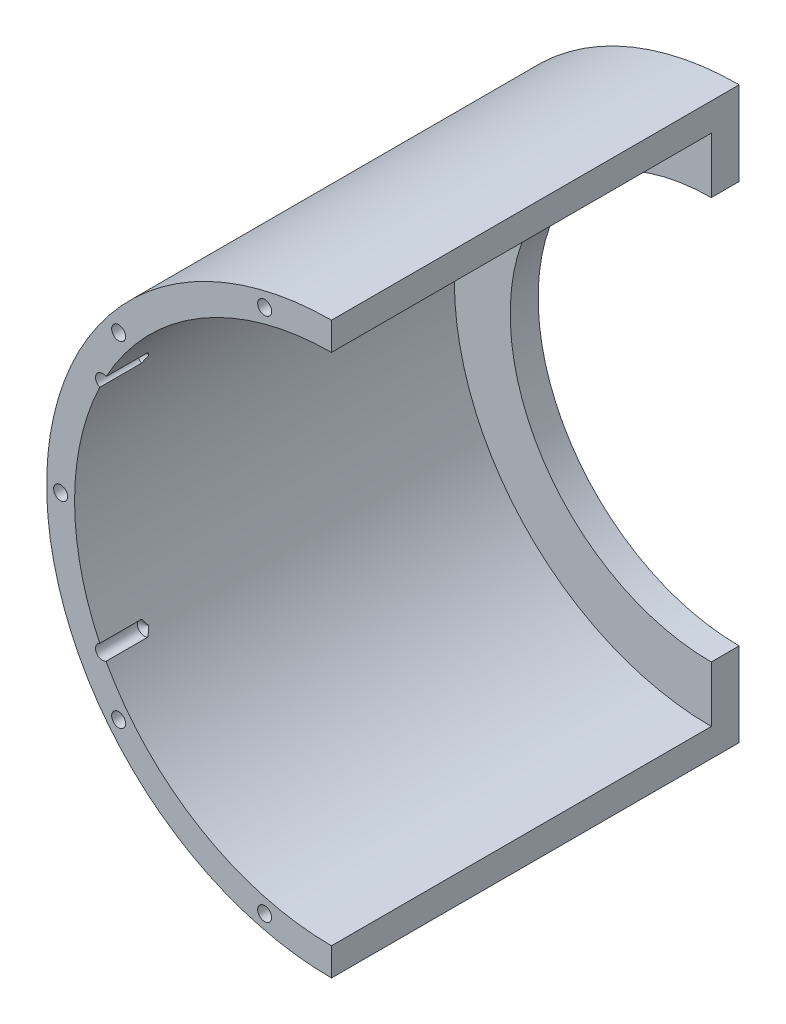
ISO-10303-21;
HEADER;
FILE_DESCRIPTION(('STEP AP214'),'2;1');
FILE_NAME('part.step','',(''),(''),'','','');
FILE_SCHEMA(('AUTOMOTIVE_DESIGN { 1 0 10303 214 1 1 1 1 }'));
ENDSEC;
DATA;
#1=APPLICATION_CONTEXT('core data for automotive mechanical design processes');
#2=APPLICATION_PROTOCOL_DEFINITION('international standard','automotive_design',2000,#1);
#3=PRODUCT_CONTEXT('',#1,'mechanical');
#4=PRODUCT('Part','Part','',(#3));
#5=PRODUCT_RELATED_PRODUCT_CATEGORY('part','',(#4));
#6=PRODUCT_DEFINITION_FORMATION('','',#4);
#7=PRODUCT_DEFINITION_CONTEXT('part definition',#1,'design');
#8=PRODUCT_DEFINITION('design','',#6,#7);
#9=PRODUCT_DEFINITION_SHAPE('','',#8);
#10=(LENGTH_UNIT() NAMED_UNIT(*) SI_UNIT(.MILLI.,.METRE.));
#11=(NAMED_UNIT(*) PLANE_ANGLE_UNIT() SI_UNIT($,.RADIAN.));
#12=(NAMED_UNIT(*) SI_UNIT($,.STERADIAN.) SOLID_ANGLE_UNIT());
#13=UNCERTAINTY_MEASURE_WITH_UNIT(LENGTH_MEASURE(1.E-05),#10,'distance_accuracy_value','');
#14=(GEOMETRIC_REPRESENTATION_CONTEXT(3) GLOBAL_UNCERTAINTY_ASSIGNED_CONTEXT((#13)) GLOBAL_UNIT_ASSIGNED_CONTEXT((#10,
#11,#12)) REPRESENTATION_CONTEXT('',''));
#15=CARTESIAN_POINT('',(0.,0.,0.));
#16=DIRECTION('',(0.,0.,1.));
#17=DIRECTION('',(1.,0.,0.));
#18=AXIS2_PLACEMENT_3D('',#15,#16,#17);
#19=CARTESIAN_POINT('',(0.,-46.,34.));
#20=DIRECTION('',(-1.,0.,0.));
#21=DIRECTION('',(0.,-1.,0.));
#22=AXIS2_PLACEMENT_3D('',#19,#20,#21);
#23=PLANE('',#22);
#24=DIRECTION('',(0.,1.,0.));
#25=VECTOR('',#24,1.);
#26=CARTESIAN_POINT('',(0.,-46.,34.));
#27=LINE('',#26,#25);
#28=CARTESIAN_POINT('',(0.,46.,34.));
#29=VERTEX_POINT('',#28);
#30=CARTESIAN_POINT('',(0.,51.,34.));
#31=VERTEX_POINT('',#30);
#32=EDGE_CURVE('E222',#29,#31,#27,.T.);
#33=ORIENTED_EDGE('',*,*,#32,.F.);
#34=DIRECTION('',(0.,0.,-1.));
#35=VECTOR('',#34,1.);
#36=CARTESIAN_POINT('',(0.,46.,34.));
#37=LINE('',#36,#35);
#38=CARTESIAN_POINT('',(0.,46.,-34.));
#39=VERTEX_POINT('',#38);
#40=EDGE_CURVE('E275',#29,#39,#37,.T.);
#41=ORIENTED_EDGE('',*,*,#40,.T.);
#42=DIRECTION('',(0.,-1.,0.));
#43=VECTOR('',#42,1.);
#44=CARTESIAN_POINT('',(0.,51.,-34.));
#45=LINE('',#44,#43);
#46=CARTESIAN_POINT('',(0.,36.,-34.));
#47=VERTEX_POINT('',#46);
#48=EDGE_CURVE('E228',#39,#47,#45,.T.);
#49=ORIENTED_EDGE('',*,*,#48,.T.);
#50=DIRECTION('',(0.,0.,1.));
#51=VECTOR('',#50,1.);
#52=CARTESIAN_POINT('',(0.,36.,-39.));
#53=LINE('',#52,#51);
#54=CARTESIAN_POINT('',(0.,36.,-39.));
#55=VERTEX_POINT('',#54);
#56=EDGE_CURVE('E404',#55,#47,#53,.T.);
#57=ORIENTED_EDGE('',*,*,#56,.F.);
#58=DIRECTION('',(0.,-1.,0.));
#59=VECTOR('',#58,1.);
#60=CARTESIAN_POINT('',(0.,51.,-39.));
#61=LINE('',#60,#59);
#62=CARTESIAN_POINT('',(0.,51.,-39.));
#63=VERTEX_POINT('',#62);
#64=EDGE_CURVE('E232',#63,#55,#61,.T.);
#65=ORIENTED_EDGE('',*,*,#64,.F.);
#66=DIRECTION('',(0.,0.,-1.));
#67=VECTOR('',#66,1.);
#68=CARTESIAN_POINT('',(0.,51.,34.));
#69=LINE('',#68,#67);
#70=EDGE_CURVE('E315',#31,#63,#69,.T.);
#71=ORIENTED_EDGE('',*,*,#70,.F.);
#72=EDGE_LOOP('',(#33,#41,#49,#57,#65,#71));
#73=FACE_BOUND('',#72,.T.);
#74=ADVANCED_FACE('F76',(#73),#23,.F.);
#75=DIRECTION('',(0.,1.,0.));
#76=VECTOR('',#75,1.);
#77=CARTESIAN_POINT('',(0.,-46.,34.));
#78=LINE('',#77,#76);
#79=CARTESIAN_POINT('',(0.,-51.,34.));
#80=VERTEX_POINT('',#79);
#81=CARTESIAN_POINT('',(0.,-46.,34.));
#82=VERTEX_POINT('',#81);
#83=EDGE_CURVE('E219',#80,#82,#78,.T.);
#84=ORIENTED_EDGE('',*,*,#83,.F.);
#85=DIRECTION('',(0.,0.,-1.));
#86=VECTOR('',#85,1.);
#87=CARTESIAN_POINT('',(0.,-51.,34.));
#88=LINE('',#87,#86);
#89=CARTESIAN_POINT('',(0.,-51.,-39.));
#90=VERTEX_POINT('',#89);
#91=EDGE_CURVE('E317',#80,#90,#88,.T.);
#92=ORIENTED_EDGE('',*,*,#91,.T.);
#93=DIRECTION('',(0.,-1.,0.));
#94=VECTOR('',#93,1.);
#95=CARTESIAN_POINT('',(0.,-51.,-39.));
#96=LINE('',#95,#94);
#97=CARTESIAN_POINT('',(0.,-36.,-39.));
#98=VERTEX_POINT('',#97);
#99=EDGE_CURVE('E237',#98,#90,#96,.T.);
#100=ORIENTED_EDGE('',*,*,#99,.F.);
#101=DIRECTION('',(0.,0.,1.));
#102=VECTOR('',#101,1.);
#103=CARTESIAN_POINT('',(0.,-36.,-39.));
#104=LINE('',#103,#102);
#105=CARTESIAN_POINT('',(0.,-36.,-34.));
#106=VERTEX_POINT('',#105);
#107=EDGE_CURVE('E240',#98,#106,#104,.T.);
#108=ORIENTED_EDGE('',*,*,#107,.T.);
#109=DIRECTION('',(0.,-1.,0.));
#110=VECTOR('',#109,1.);
#111=CARTESIAN_POINT('',(0.,-51.,-34.));
#112=LINE('',#111,#110);
#113=CARTESIAN_POINT('',(0.,-46.,-34.));
#114=VERTEX_POINT('',#113);
#115=EDGE_CURVE('E233',#106,#114,#112,.T.);
#116=ORIENTED_EDGE('',*,*,#115,.T.);
#117=DIRECTION('',(0.,0.,-1.));
#118=VECTOR('',#117,1.);
#119=CARTESIAN_POINT('',(0.,-46.,34.));
#120=LINE('',#119,#118);
#121=EDGE_CURVE('E326',#82,#114,#120,.T.);
#122=ORIENTED_EDGE('',*,*,#121,.F.);
#123=EDGE_LOOP('',(#84,#92,#100,#108,#116,#122));
#124=FACE_BOUND('',#123,.T.);
#125=ADVANCED_FACE('F299',(#124),#23,.F.);
#126=CARTESIAN_POINT('',(0.,0.,34.));
#127=DIRECTION('',(0.,0.,-1.));
#128=DIRECTION('',(-1.,0.,0.));
#129=AXIS2_PLACEMENT_3D('',#126,#127,#128);
#130=CYLINDRICAL_SURFACE('',#129,51.);
#131=CARTESIAN_POINT('',(0.,0.,34.));
#132=DIRECTION('',(0.,0.,1.));
#133=DIRECTION('',(1.,0.,0.));
#134=AXIS2_PLACEMENT_3D('',#131,#132,#133);
#135=CIRCLE('',#134,51.);
#136=EDGE_CURVE('E223',#31,#80,#135,.T.);
#137=ORIENTED_EDGE('',*,*,#136,.F.);
#138=ORIENTED_EDGE('',*,*,#70,.T.);
#139=CARTESIAN_POINT('',(0.,0.,-39.));
#140=DIRECTION('',(0.,0.,-1.));
#141=DIRECTION('',(-1.,0.,0.));
#142=AXIS2_PLACEMENT_3D('',#139,#140,#141);
#143=CIRCLE('',#142,51.);
#144=EDGE_CURVE('E229',#90,#63,#143,.T.);
#145=ORIENTED_EDGE('',*,*,#144,.F.);
#146=ORIENTED_EDGE('',*,*,#91,.F.);
#147=EDGE_LOOP('',(#137,#138,#145,#146));
#148=FACE_BOUND('',#147,.T.);
#149=ADVANCED_FACE('F301',(#148),#130,.T.);
#150=CARTESIAN_POINT('',(-41.,21.,39.));
#151=DIRECTION('',(0.,0.,1.));
#152=DIRECTION('',(1.,0.,0.));
#153=AXIS2_PLACEMENT_3D('',#150,#151,#152);
#154=CYLINDRICAL_SURFACE('',#153,1.24999999999999);
#155=CARTESIAN_POINT('',(-41.,21.,34.));
#156=DIRECTION('',(0.,0.,1.));
#157=DIRECTION('',(1.,0.,0.));
#158=AXIS2_PLACEMENT_3D('',#155,#156,#157);
#159=CIRCLE('',#158,1.24999999999999);
#160=CARTESIAN_POINT('',(-41.4955558245157,19.8524267235646,34.));
#161=VERTEX_POINT('',#160);
#162=CARTESIAN_POINT('',(-40.358326126474,22.0727323245032,34.));
#163=VERTEX_POINT('',#162);
#164=EDGE_CURVE('E214',#161,#163,#159,.F.);
#165=ORIENTED_EDGE('',*,*,#164,.F.);
#166=DIRECTION('',(0.,0.,1.));
#167=VECTOR('',#166,1.);
#168=CARTESIAN_POINT('',(-41.4955558245157,19.8524267235646,32.75));
#169=LINE('',#168,#167);
#170=CARTESIAN_POINT('',(-41.4955558245157,19.8524267235646,26.5));
#171=VERTEX_POINT('',#170);
#172=EDGE_CURVE('E274',#171,#161,#169,.T.);
#173=ORIENTED_EDGE('',*,*,#172,.F.);
#174=CARTESIAN_POINT('',(-41.,21.,26.5));
#175=DIRECTION('',(0.,0.,1.));
#176=DIRECTION('',(1.,0.,0.));
#177=AXIS2_PLACEMENT_3D('',#174,#175,#176);
#178=CIRCLE('',#177,1.24999999999999);
#179=CARTESIAN_POINT('',(-40.358326126474,22.0727323245032,26.5));
#180=VERTEX_POINT('',#179);
#181=EDGE_CURVE('E98',#180,#171,#178,.T.);
#182=ORIENTED_EDGE('',*,*,#181,.F.);
#183=DIRECTION('',(0.,0.,1.));
#184=VECTOR('',#183,1.);
#185=CARTESIAN_POINT('',(-40.358326126474,22.0727323245032,32.75));
#186=LINE('',#185,#184);
#187=EDGE_CURVE('E339',#163,#180,#186,.F.);
#188=ORIENTED_EDGE('',*,*,#187,.F.);
#189=EDGE_LOOP('',(#165,#173,#182,#188));
#190=FACE_BOUND('',#189,.T.);
#191=ADVANCED_FACE('F285',(#190),#154,.F.);
#192=CARTESIAN_POINT('',(-41.,-21.,39.));
#193=DIRECTION('',(0.,0.,1.));
#194=DIRECTION('',(1.,0.,0.));
#195=AXIS2_PLACEMENT_3D('',#192,#193,#194);
#196=CYLINDRICAL_SURFACE('',#195,1.24999999999999);
#197=CARTESIAN_POINT('',(-41.,-21.,34.));
#198=DIRECTION('',(0.,0.,1.));
#199=DIRECTION('',(1.,0.,0.));
#200=AXIS2_PLACEMENT_3D('',#197,#198,#199);
#201=CIRCLE('',#200,1.24999999999999);
#202=CARTESIAN_POINT('',(-40.358326126474,-22.0727323245032,34.));
#203=VERTEX_POINT('',#202);
#204=CARTESIAN_POINT('',(-41.4955558245157,-19.8524267235647,34.));
#205=VERTEX_POINT('',#204);
#206=EDGE_CURVE('E212',#203,#205,#201,.F.);
#207=ORIENTED_EDGE('',*,*,#206,.F.);
#208=DIRECTION('',(0.,0.,1.));
#209=VECTOR('',#208,1.);
#210=CARTESIAN_POINT('',(-40.358326126474,-22.0727323245032,32.75));
#211=LINE('',#210,#209);
#212=CARTESIAN_POINT('',(-40.358326126474,-22.0727323245032,26.5));
#213=VERTEX_POINT('',#212);
#214=EDGE_CURVE('E85',#213,#203,#211,.T.);
#215=ORIENTED_EDGE('',*,*,#214,.F.);
#216=CARTESIAN_POINT('',(-41.,-21.,26.5));
#217=DIRECTION('',(0.,0.,1.));
#218=DIRECTION('',(1.,0.,0.));
#219=AXIS2_PLACEMENT_3D('',#216,#217,#218);
#220=CIRCLE('',#219,1.24999999999999);
#221=CARTESIAN_POINT('',(-41.4955558245157,-19.8524267235647,26.5));
#222=VERTEX_POINT('',#221);
#223=EDGE_CURVE('E91',#222,#213,#220,.T.);
#224=ORIENTED_EDGE('',*,*,#223,.F.);
#225=DIRECTION('',(0.,0.,1.));
#226=VECTOR('',#225,1.);
#227=CARTESIAN_POINT('',(-41.4955558245157,-19.8524267235647,32.75));
#228=LINE('',#227,#226);
#229=EDGE_CURVE('E12',#205,#222,#228,.F.);
#230=ORIENTED_EDGE('',*,*,#229,.F.);
#231=EDGE_LOOP('',(#207,#215,#224,#230));
#232=FACE_BOUND('',#231,.T.);
#233=ADVANCED_FACE('F308',(#232),#196,.F.);
#234=CARTESIAN_POINT('',(0.,0.,34.));
#235=DIRECTION('',(0.,0.,-1.));
#236=DIRECTION('',(-1.,0.,0.));
#237=AXIS2_PLACEMENT_3D('',#234,#235,#236);
#238=CYLINDRICAL_SURFACE('',#237,46.);
#239=CARTESIAN_POINT('',(0.,0.,34.));
#240=DIRECTION('',(0.,0.,-1.));
#241=DIRECTION('',(1.,0.,0.));
#242=AXIS2_PLACEMENT_3D('',#239,#240,#241);
#243=CIRCLE('',#242,46.);
#244=EDGE_CURVE('E264',#205,#161,#243,.T.);
#245=ORIENTED_EDGE('',*,*,#244,.F.);
#246=ORIENTED_EDGE('',*,*,#229,.T.);
#247=CARTESIAN_POINT('',(-41.4956995825594,-19.8521262376095,26.5002));
#248=CARTESIAN_POINT('',(-41.4529847862643,-19.9414097330484,26.4407981539225));
#249=CARTESIAN_POINT('',(-41.4099867982843,-20.0305462840679,26.3813786853314));
#250=CARTESIAN_POINT('',(-41.3234187855771,-20.2085342293242,26.2626373794059));
#251=CARTESIAN_POINT('',(-41.279849046142,-20.2973857401619,26.2033155088455));
#252=CARTESIAN_POINT('',(-41.2126849666767,-20.4332414773035,26.1126463000424));
#253=CARTESIAN_POINT('',(-41.1893128839904,-20.4803141586177,26.0812367755799));
#254=CARTESIAN_POINT('',(-41.1423708640909,-20.5744523272326,26.0185170356505));
#255=CARTESIAN_POINT('',(-41.1188008666766,-20.6215178075569,25.9872068547101));
#256=CARTESIAN_POINT('',(-41.0826360128409,-20.6934237926229,25.9396831949189));
#257=CARTESIAN_POINT('',(-41.0701326464213,-20.7182282058377,25.9233460804699));
#258=CARTESIAN_POINT('',(-41.0513032488208,-20.7554979457542,25.8990217345552));
#259=CARTESIAN_POINT('',(-41.045017044528,-20.7679264848846,25.8909471898548));
#260=CARTESIAN_POINT('',(-41.0324057249485,-20.7928323089798,25.8748925904273));
#261=CARTESIAN_POINT('',(-41.0260805977791,-20.8053096083584,25.8669125669784));
#262=CARTESIAN_POINT('',(-41.0129664937335,-20.8311498127179,25.8506294405904));
#263=CARTESIAN_POINT('',(-41.0061737482559,-20.8445182687412,25.8423383670525));
#264=CARTESIAN_POINT('',(-40.9924737563145,-20.8714475887067,25.8261769583568));
#265=CARTESIAN_POINT('',(-40.9855665982152,-20.8850083030928,25.8183063166745));
#266=CARTESIAN_POINT('',(-40.9745758010745,-20.9065590888664,25.8070212985044));
#267=CARTESIAN_POINT('',(-40.9705904331746,-20.9143682544076,25.8031724997402));
#268=CARTESIAN_POINT('',(-40.9624690096902,-20.9302702352784,25.7963231069303));
#269=CARTESIAN_POINT('',(-40.9583335362687,-20.9383619509273,25.7933195640453));
#270=CARTESIAN_POINT('',(-40.9510231875199,-20.952654842654,25.7896878438891));
#271=CARTESIAN_POINT('',(-40.9478980786519,-20.9587616708702,25.7886329354238));
#272=CARTESIAN_POINT('',(-40.9416202863277,-20.9710222774739,25.787872002997));
#273=CARTESIAN_POINT('',(-40.9384677852041,-20.9771757301344,25.7881600521601));
#274=CARTESIAN_POINT('',(-40.9309772684941,-20.9917886909222,25.7903011504695));
#275=CARTESIAN_POINT('',(-40.9266776485166,-21.0001700123437,25.7927421753707));
#276=CARTESIAN_POINT('',(-40.9182222928856,-21.016640357016,25.7988455004899));
#277=CARTESIAN_POINT('',(-40.9140692500728,-21.0247239729831,25.802523695133));
#278=CARTESIAN_POINT('',(-40.9052226175996,-21.0419312323837,25.8110550710831));
#279=CARTESIAN_POINT('',(-40.900547509627,-21.051016985727,25.8160020810258));
#280=CARTESIAN_POINT('',(-40.8912706254135,-21.0690315204962,25.8262422333608));
#281=CARTESIAN_POINT('',(-40.8866688934817,-21.077960207388,25.8315355757271));
#282=CARTESIAN_POINT('',(-40.8729085233348,-21.1046381189273,25.8476923696816));
#283=CARTESIAN_POINT('',(-40.8638065999656,-21.1222560719243,25.8588197500405));
#284=CARTESIAN_POINT('',(-40.8457035820988,-21.157241865441,25.8812458793441));
#285=CARTESIAN_POINT('',(-40.8367022151804,-21.1746105851576,25.8925430743677));
#286=CARTESIAN_POINT('',(-40.8187182538988,-21.2092579032061,25.9152528323287));
#287=CARTESIAN_POINT('',(-40.8097356501185,-21.2265365649745,25.9266652904081));
#288=CARTESIAN_POINT('',(-40.7826761266576,-21.2785069959272,25.961132069829));
#289=CARTESIAN_POINT('',(-40.7645923941332,-21.3131304896296,25.9842835434161));
#290=CARTESIAN_POINT('',(-40.7283639310883,-21.3822799121501,26.0306853004193));
#291=CARTESIAN_POINT('',(-40.710219199753,-21.4168058396532,26.0539355851565));
#292=CARTESIAN_POINT('',(-40.6556593354815,-21.5203032159219,26.1237780354759));
#293=CARTESIAN_POINT('',(-40.6191328987085,-21.5891666673456,26.1704433330051));
#294=CARTESIAN_POINT('',(-40.5453963642661,-21.72733353813,26.2642823335021));
#295=CARTESIAN_POINT('',(-40.5081830694087,-21.7966348513513,26.3114566237856));
#296=CARTESIAN_POINT('',(-40.4334271075122,-21.9349983444142,26.4058195497303));
#297=CARTESIAN_POINT('',(-40.395884586366,-22.0040606129641,26.453008170896));
#298=CARTESIAN_POINT('',(-40.3581662881887,-22.0730245742378,26.5002000000003));
#299=B_SPLINE_CURVE_WITH_KNOTS('',3,(#247,#248,#249,#250,#251,#252,#253,#254,#255,#256,#257,
#258,#259,#260,#261,#262,#263,#264,#265,#266,#267,#268,#269,#270,#271,#272,#273,#274,#275,#276,
#277,#278,#279,#280,#281,#282,#283,#284,#285,#286,#287,#288,#289,#290,#291,#292,#293,#294,#295,
#296,#297,#298),.UNSPECIFIED.,.F.,.F.,(4,2,2,2,2,2,2,2,2,2,2,2,2,2,2,2,2,2,2,2,2,2,2,2,2,4),(0.,
0.346297626729227,0.69242857459747,0.876106960281486,1.05984340127595,1.15651958106071,
1.20481716210386,1.25313030241438,1.30453688846685,1.35590546910773,1.38461843087848,
1.41322994370057,1.43394754258295,1.4545737952485,1.48357533903418,1.51296469176693,
1.54700560504111,1.5810663501927,1.64927477236423,1.71704635975187,1.78476103031148,
1.92098173986908,2.05720427660644,2.32975787197577,2.60492283840176,2.87997147885422),.UNSPECIFIED.);
#300=EDGE_CURVE('E340',#222,#213,#299,.T.);
#301=ORIENTED_EDGE('',*,*,#300,.T.);
#302=ORIENTED_EDGE('',*,*,#214,.T.);
#303=EDGE_CURVE('E256',#82,#203,#243,.T.);
#304=ORIENTED_EDGE('',*,*,#303,.F.);
#305=ORIENTED_EDGE('',*,*,#121,.T.);
#306=CARTESIAN_POINT('',(0.,0.,-34.));
#307=DIRECTION('',(0.,0.,-1.));
#308=DIRECTION('',(1.,0.,0.));
#309=AXIS2_PLACEMENT_3D('',#306,#307,#308);
#310=CIRCLE('',#309,46.);
#311=EDGE_CURVE('E265',#114,#39,#310,.T.);
#312=ORIENTED_EDGE('',*,*,#311,.T.);
#313=ORIENTED_EDGE('',*,*,#40,.F.);
#314=EDGE_CURVE('E261',#163,#29,#243,.T.);
#315=ORIENTED_EDGE('',*,*,#314,.F.);
#316=ORIENTED_EDGE('',*,*,#187,.T.);
#317=CARTESIAN_POINT('',(-40.3581662881887,22.0730245742378,26.5002000000003));
#318=CARTESIAN_POINT('',(-40.4056591400927,21.986188375574,26.4407981539228));
#319=CARTESIAN_POINT('',(-40.4528672625057,21.8992082348738,26.3813786853316));
#320=CARTESIAN_POINT('',(-40.5467178308254,21.7249503790775,26.2626373794061));
#321=CARTESIAN_POINT('',(-40.5933605380653,21.6376728273592,26.2033155088456));
#322=CARTESIAN_POINT('',(-40.6643596524955,21.5037813764191,26.1126463000425));
#323=CARTESIAN_POINT('',(-40.6889014878829,21.4573078367323,26.08123677558));
#324=CARTESIAN_POINT('',(-40.737863703566,21.3642044025431,26.0185170356506));
#325=CARTESIAN_POINT('',(-40.7622840430216,21.3175744632644,25.9872068547102));
#326=CARTESIAN_POINT('',(-40.7995025574077,21.2462081579924,25.939683194919));
#327=CARTESIAN_POINT('',(-40.8123249066988,21.2215671262483,25.92334608047));
#328=CARTESIAN_POINT('',(-40.8315662069399,21.1845083608551,25.8990217345553));
#329=CARTESIAN_POINT('',(-40.8379785778444,21.1721444436477,25.8909471898549));
#330=CARTESIAN_POINT('',(-40.8508201390194,21.1473565481747,25.8748925904273));
#331=CARTESIAN_POINT('',(-40.8572493340429,21.1349325518432,25.8669125669784));
#332=CARTESIAN_POINT('',(-40.8705553391752,21.1091906382841,25.8506294405905));
#333=CARTESIAN_POINT('',(-40.8774344517482,21.0958664190658,25.8423383670525));
#334=CARTESIAN_POINT('',(-40.8912819064952,21.0690126288301,25.8261769583568));
#335=CARTESIAN_POINT('',(-40.8982501789409,21.0554832169141,25.8183063166745));
#336=CARTESIAN_POINT('',(-40.9093160906505,21.0339709044561,25.8070212985044));
#337=CARTESIAN_POINT('',(-40.913324350248,21.0261734639309,25.8031724997402));
#338=CARTESIAN_POINT('',(-40.9214829958366,21.0102905480402,25.7963231069303));
#339=CARTESIAN_POINT('',(-40.9256328296277,21.0022061877026,25.7933195640453));
#340=CARTESIAN_POINT('',(-40.932959656727,20.9879217361067,25.7896878438891));
#341=CARTESIAN_POINT('',(-40.9360891681276,20.9818171628461,25.7886329354238));
#342=CARTESIAN_POINT('',(-40.9423701775949,20.9695582040475,25.787872002997));
#343=CARTESIAN_POINT('',(-40.9455215178815,20.9634041568119,25.7881600521601));
#344=CARTESIAN_POINT('',(-40.9530027986337,20.9487864654115,25.7903011504695));
#345=CARTESIAN_POINT('',(-40.9572917273404,20.9403996679733,25.7927421753707));
#346=CARTESIAN_POINT('',(-40.965716464637,20.9239136407395,25.7988455004899));
#347=CARTESIAN_POINT('',(-40.9698494587969,20.9158197559503,25.802523695133));
#348=CARTESIAN_POINT('',(-40.9786435570161,20.898585588761,25.8110550710831));
#349=CARTESIAN_POINT('',(-40.983284713176,20.8894824454648,25.8160020810258));
#350=CARTESIAN_POINT('',(-40.9924824947254,20.8714273946969,25.8262422333608));
#351=CARTESIAN_POINT('',(-40.9970390692929,20.8624755784234,25.8315355757271));
#352=CARTESIAN_POINT('',(-41.0106472241885,20.8357197029749,25.8476923696815));
#353=CARTESIAN_POINT('',(-41.0196254193265,20.8180383769815,25.8588197500405));
#354=CARTESIAN_POINT('',(-41.037437763474,20.7829037018037,25.881245879344));
#355=CARTESIAN_POINT('',(-41.0462724667601,20.7654496177877,25.8925430743677));
#356=CARTESIAN_POINT('',(-41.063879709781,20.7306093464837,25.9152528323287));
#357=CARTESIAN_POINT('',(-41.0726522954915,20.7132231144844,25.9266652904081));
#358=CARTESIAN_POINT('',(-41.0990138756088,20.6608952003558,25.9611320698289));
#359=CARTESIAN_POINT('',(-41.1165434834435,20.6259878866904,25.984283543416));
#360=CARTESIAN_POINT('',(-41.1514878809009,20.5561807720398,26.0306853004192));
#361=CARTESIAN_POINT('',(-41.1689026689803,20.5212809711617,26.0539355851563));
#362=CARTESIAN_POINT('',(-41.2210083476976,20.4165265730238,26.1237780354757));
#363=CARTESIAN_POINT('',(-41.2555465577603,20.3466447615778,26.1704433330049));
#364=CARTESIAN_POINT('',(-41.3245805110035,20.2060692516427,26.2642823335018));
#365=CARTESIAN_POINT('',(-41.359072676764,20.1353741893718,26.3114566237854));
#366=CARTESIAN_POINT('',(-41.4276704818077,19.9938565184088,26.40581954973));
#367=CARTESIAN_POINT('',(-41.4617762783305,19.9230339762713,26.4530081708957));
#368=CARTESIAN_POINT('',(-41.4956995825594,19.8521262376094,26.5002));
#369=B_SPLINE_CURVE_WITH_KNOTS('',3,(#317,#318,#319,#320,#321,#322,#323,#324,#325,#326,#327,
#328,#329,#330,#331,#332,#333,#334,#335,#336,#337,#338,#339,#340,#341,#342,#343,#344,#345,#346,
#347,#348,#349,#350,#351,#352,#353,#354,#355,#356,#357,#358,#359,#360,#361,#362,#363,#364,#365,
#366,#367,#368),.UNSPECIFIED.,.F.,.F.,(4,2,2,2,2,2,2,2,2,2,2,2,2,2,2,2,2,2,2,2,2,2,2,2,2,4),(0.,
0.346297626729407,0.692428574597834,0.876106960281913,1.05984340127645,1.15651958106124,
1.20481716210442,1.25313030241496,1.30453688846745,1.35590546910835,1.38461843087911,
1.4132299437012,1.43394754258359,1.45457379524914,1.48357533903481,1.51296469176754,
1.54700560504172,1.58106635019329,1.64927477236479,1.7170463597524,1.78476103031198,
1.92098173986951,2.0572042766068,2.32975787197601,2.60492283840187,2.87997147885421),.UNSPECIFIED.);
#370=EDGE_CURVE('E267',#180,#171,#369,.T.);
#371=ORIENTED_EDGE('',*,*,#370,.T.);
#372=ORIENTED_EDGE('',*,*,#172,.T.);
#373=EDGE_LOOP('',(#245,#246,#301,#302,#304,#305,#312,#313,#315,#316,#371,#372));
#374=FACE_BOUND('',#373,.T.);
#375=ADVANCED_FACE('F78',(#374),#238,.F.);
#376=CARTESIAN_POINT('',(0.,0.,-39.));
#377=DIRECTION('',(0.,0.,1.));
#378=DIRECTION('',(1.,0.,0.));
#379=AXIS2_PLACEMENT_3D('',#376,#377,#378);
#380=CYLINDRICAL_SURFACE('',#379,36.);
#381=CARTESIAN_POINT('',(0.,0.,-34.));
#382=DIRECTION('',(0.,0.,1.));
#383=DIRECTION('',(-1.,0.,0.));
#384=AXIS2_PLACEMENT_3D('',#381,#382,#383);
#385=CIRCLE('',#384,36.);
#386=EDGE_CURVE('E243',#47,#106,#385,.T.);
#387=ORIENTED_EDGE('',*,*,#386,.T.);
#388=ORIENTED_EDGE('',*,*,#107,.F.);
#389=CARTESIAN_POINT('',(0.,0.,-39.));
#390=DIRECTION('',(0.,0.,1.));
#391=DIRECTION('',(-1.,0.,0.));
#392=AXIS2_PLACEMENT_3D('',#389,#390,#391);
#393=CIRCLE('',#392,36.);
#394=EDGE_CURVE('E235',#55,#98,#393,.T.);
#395=ORIENTED_EDGE('',*,*,#394,.F.);
#396=ORIENTED_EDGE('',*,*,#56,.T.);
#397=EDGE_LOOP('',(#387,#388,#395,#396));
#398=FACE_BOUND('',#397,.T.);
#399=ADVANCED_FACE('F290',(#398),#380,.F.);
#400=CARTESIAN_POINT('',(0.,0.,-39.));
#401=DIRECTION('',(0.,0.,-1.));
#402=DIRECTION('',(-1.,0.,0.));
#403=AXIS2_PLACEMENT_3D('',#400,#401,#402);
#404=PLANE('',#403);
#405=ORIENTED_EDGE('',*,*,#144,.T.);
#406=ORIENTED_EDGE('',*,*,#64,.T.);
#407=ORIENTED_EDGE('',*,*,#394,.T.);
#408=ORIENTED_EDGE('',*,*,#99,.T.);
#409=EDGE_LOOP('',(#405,#406,#407,#408));
#410=FACE_BOUND('',#409,.T.);
#411=ADVANCED_FACE('F287',(#410),#404,.T.);
#412=CARTESIAN_POINT('',(0.,0.,-34.));
#413=DIRECTION('',(0.,0.,-1.));
#414=DIRECTION('',(-1.,0.,0.));
#415=AXIS2_PLACEMENT_3D('',#412,#413,#414);
#416=PLANE('',#415);
#417=ORIENTED_EDGE('',*,*,#311,.F.);
#418=ORIENTED_EDGE('',*,*,#115,.F.);
#419=ORIENTED_EDGE('',*,*,#386,.F.);
#420=ORIENTED_EDGE('',*,*,#48,.F.);
#421=EDGE_LOOP('',(#417,#418,#419,#420));
#422=FACE_BOUND('',#421,.T.);
#423=ADVANCED_FACE('F283',(#422),#416,.F.);
#424=CARTESIAN_POINT('',(-41.,21.,26.5));
#425=DIRECTION('',(0.,0.,1.));
#426=DIRECTION('',(1.,0.,0.));
#427=AXIS2_PLACEMENT_3D('',#424,#425,#426);
#428=CONICAL_SURFACE('',#427,1.24999999999999,1.02974425867665);
#429=CARTESIAN_POINT('',(-41.,21.,25.7489242262155));
#430=VERTEX_POINT('',#429);
#431=VERTEX_LOOP('',#430);
#432=FACE_BOUND('',#431,.T.);
#433=ORIENTED_EDGE('',*,*,#181,.T.);
#434=ORIENTED_EDGE('',*,*,#370,.F.);
#435=EDGE_LOOP('',(#433,#434));
#436=FACE_BOUND('',#435,.T.);
#437=ADVANCED_FACE('F277',(#432,#436),#428,.F.);
#438=CARTESIAN_POINT('',(-41.,-21.,26.5));
#439=DIRECTION('',(0.,0.,1.));
#440=DIRECTION('',(1.,0.,0.));
#441=AXIS2_PLACEMENT_3D('',#438,#439,#440);
#442=CONICAL_SURFACE('',#441,1.24999999999999,1.02974425867665);
#443=CARTESIAN_POINT('',(-41.,-21.,25.7489242262155));
#444=VERTEX_POINT('',#443);
#445=VERTEX_LOOP('',#444);
#446=FACE_BOUND('',#445,.T.);
#447=ORIENTED_EDGE('',*,*,#223,.T.);
#448=ORIENTED_EDGE('',*,*,#300,.F.);
#449=EDGE_LOOP('',(#447,#448));
#450=FACE_BOUND('',#449,.T.);
#451=ADVANCED_FACE('F282',(#446,#450),#442,.F.);
#452=CARTESIAN_POINT('',(0.,0.,34.));
#453=DIRECTION('',(0.,0.,1.));
#454=DIRECTION('',(1.,0.,0.));
#455=AXIS2_PLACEMENT_3D('',#452,#453,#454);
#456=PLANE('',#455);
#457=CARTESIAN_POINT('',(-11.9687092035858,-47.,34.));
#458=DIRECTION('',(0.,0.,1.));
#459=DIRECTION('',(1.,0.,0.));
#460=AXIS2_PLACEMENT_3D('',#457,#458,#459);
#461=CIRCLE('',#460,1.24999999999999);
#462=CARTESIAN_POINT('',(-10.7187092035858,-47.,34.));
#463=VERTEX_POINT('',#462);
#464=EDGE_CURVE('E184',#463,#463,#461,.T.);
#465=ORIENTED_EDGE('',*,*,#464,.F.);
#466=EDGE_LOOP('',(#465));
#467=FACE_BOUND('',#466,.T.);
#468=CARTESIAN_POINT('',(-38.1083980245825,-30.,34.));
#469=DIRECTION('',(0.,0.,1.));
#470=DIRECTION('',(1.,0.,0.));
#471=AXIS2_PLACEMENT_3D('',#468,#469,#470);
#472=CIRCLE('',#471,1.24999999999999);
#473=CARTESIAN_POINT('',(-36.8583980245825,-30.,34.));
#474=VERTEX_POINT('',#473);
#475=EDGE_CURVE('E183',#474,#474,#472,.T.);
#476=ORIENTED_EDGE('',*,*,#475,.F.);
#477=EDGE_LOOP('',(#476));
#478=FACE_BOUND('',#477,.T.);
#479=CARTESIAN_POINT('',(-48.5,0.,34.));
#480=DIRECTION('',(0.,0.,1.));
#481=DIRECTION('',(1.,0.,0.));
#482=AXIS2_PLACEMENT_3D('',#479,#480,#481);
#483=CIRCLE('',#482,1.24999999999999);
#484=CARTESIAN_POINT('',(-47.25,0.,34.));
#485=VERTEX_POINT('',#484);
#486=EDGE_CURVE('E194',#485,#485,#483,.T.);
#487=ORIENTED_EDGE('',*,*,#486,.F.);
#488=EDGE_LOOP('',(#487));
#489=FACE_BOUND('',#488,.T.);
#490=CARTESIAN_POINT('',(-38.1083980245825,30.,34.));
#491=DIRECTION('',(0.,0.,1.));
#492=DIRECTION('',(1.,0.,0.));
#493=AXIS2_PLACEMENT_3D('',#490,#491,#492);
#494=CIRCLE('',#493,1.24999999999999);
#495=CARTESIAN_POINT('',(-36.8583980245825,30.,34.));
#496=VERTEX_POINT('',#495);
#497=EDGE_CURVE('E200',#496,#496,#494,.T.);
#498=ORIENTED_EDGE('',*,*,#497,.F.);
#499=EDGE_LOOP('',(#498));
#500=FACE_BOUND('',#499,.T.);
#501=CARTESIAN_POINT('',(-11.9687092035858,47.,34.));
#502=DIRECTION('',(0.,0.,1.));
#503=DIRECTION('',(1.,0.,0.));
#504=AXIS2_PLACEMENT_3D('',#501,#502,#503);
#505=CIRCLE('',#504,1.24999999999999);
#506=CARTESIAN_POINT('',(-10.7187092035858,47.,34.));
#507=VERTEX_POINT('',#506);
#508=EDGE_CURVE('E206',#507,#507,#505,.T.);
#509=ORIENTED_EDGE('',*,*,#508,.F.);
#510=EDGE_LOOP('',(#509));
#511=FACE_BOUND('',#510,.T.);
#512=ORIENTED_EDGE('',*,*,#32,.T.);
#513=ORIENTED_EDGE('',*,*,#136,.T.);
#514=ORIENTED_EDGE('',*,*,#83,.T.);
#515=ORIENTED_EDGE('',*,*,#303,.T.);
#516=ORIENTED_EDGE('',*,*,#206,.T.);
#517=ORIENTED_EDGE('',*,*,#244,.T.);
#518=ORIENTED_EDGE('',*,*,#164,.T.);
#519=ORIENTED_EDGE('',*,*,#314,.T.);
#520=EDGE_LOOP('',(#512,#513,#514,#515,#516,#517,#518,#519));
#521=FACE_BOUND('',#520,.T.);
#522=ADVANCED_FACE('F348',(#467,#478,#489,#500,#511,#521),#456,.T.);
#523=CARTESIAN_POINT('',(-11.9687092035858,47.,21.5));
#524=DIRECTION('',(0.,0.,1.));
#525=DIRECTION('',(1.,0.,0.));
#526=AXIS2_PLACEMENT_3D('',#523,#524,#525);
#527=CONICAL_SURFACE('',#526,1.24999999999999,1.02974425867665);
#528=CARTESIAN_POINT('',(-11.9687092035858,47.,20.7489242262156));
#529=VERTEX_POINT('',#528);
#530=VERTEX_LOOP('',#529);
#531=FACE_BOUND('',#530,.T.);
#532=CARTESIAN_POINT('',(-11.9687092035858,47.,21.5));
#533=DIRECTION('',(0.,0.,1.));
#534=DIRECTION('',(1.,0.,0.));
#535=AXIS2_PLACEMENT_3D('',#532,#533,#534);
#536=CIRCLE('',#535,1.24999999999999);
#537=CARTESIAN_POINT('',(-10.7187092035858,47.,21.5));
#538=VERTEX_POINT('',#537);
#539=EDGE_CURVE('E209',#538,#538,#536,.T.);
#540=ORIENTED_EDGE('',*,*,#539,.T.);
#541=EDGE_LOOP('',(#540));
#542=FACE_BOUND('',#541,.T.);
#543=ADVANCED_FACE('F355',(#531,#542),#527,.F.);
#544=CARTESIAN_POINT('',(-11.9687092035858,47.,34.));
#545=DIRECTION('',(0.,0.,1.));
#546=DIRECTION('',(1.,0.,0.));
#547=AXIS2_PLACEMENT_3D('',#544,#545,#546);
#548=CYLINDRICAL_SURFACE('',#547,1.24999999999999);
#549=ORIENTED_EDGE('',*,*,#539,.F.);
#550=EDGE_LOOP('',(#549));
#551=FACE_BOUND('',#550,.T.);
#552=ORIENTED_EDGE('',*,*,#508,.T.);
#553=EDGE_LOOP('',(#552));
#554=FACE_BOUND('',#553,.T.);
#555=ADVANCED_FACE('F359',(#551,#554),#548,.F.);
#556=CARTESIAN_POINT('',(-38.1083980245825,30.,21.5));
#557=DIRECTION('',(0.,0.,1.));
#558=DIRECTION('',(1.,0.,0.));
#559=AXIS2_PLACEMENT_3D('',#556,#557,#558);
#560=CONICAL_SURFACE('',#559,1.24999999999999,1.02974425867665);
#561=CARTESIAN_POINT('',(-38.1083980245825,30.,20.7489242262156));
#562=VERTEX_POINT('',#561);
#563=VERTEX_LOOP('',#562);
#564=FACE_BOUND('',#563,.T.);
#565=CARTESIAN_POINT('',(-38.1083980245825,30.,21.5));
#566=DIRECTION('',(0.,0.,1.));
#567=DIRECTION('',(1.,0.,0.));
#568=AXIS2_PLACEMENT_3D('',#565,#566,#567);
#569=CIRCLE('',#568,1.24999999999999);
#570=CARTESIAN_POINT('',(-36.8583980245825,30.,21.5));
#571=VERTEX_POINT('',#570);
#572=EDGE_CURVE('E203',#571,#571,#569,.T.);
#573=ORIENTED_EDGE('',*,*,#572,.T.);
#574=EDGE_LOOP('',(#573));
#575=FACE_BOUND('',#574,.T.);
#576=ADVANCED_FACE('F363',(#564,#575),#560,.F.);
#577=CARTESIAN_POINT('',(-38.1083980245825,30.,34.));
#578=DIRECTION('',(0.,0.,1.));
#579=DIRECTION('',(1.,0.,0.));
#580=AXIS2_PLACEMENT_3D('',#577,#578,#579);
#581=CYLINDRICAL_SURFACE('',#580,1.24999999999999);
#582=ORIENTED_EDGE('',*,*,#572,.F.);
#583=EDGE_LOOP('',(#582));
#584=FACE_BOUND('',#583,.T.);
#585=ORIENTED_EDGE('',*,*,#497,.T.);
#586=EDGE_LOOP('',(#585));
#587=FACE_BOUND('',#586,.T.);
#588=ADVANCED_FACE('F367',(#584,#587),#581,.F.);
#589=CARTESIAN_POINT('',(-48.5,0.,21.5));
#590=DIRECTION('',(0.,0.,1.));
#591=DIRECTION('',(1.,0.,0.));
#592=AXIS2_PLACEMENT_3D('',#589,#590,#591);
#593=CONICAL_SURFACE('',#592,1.24999999999999,1.02974425867665);
#594=CARTESIAN_POINT('',(-48.5,0.,20.7489242262156));
#595=VERTEX_POINT('',#594);
#596=VERTEX_LOOP('',#595);
#597=FACE_BOUND('',#596,.T.);
#598=CARTESIAN_POINT('',(-48.5,0.,21.5));
#599=DIRECTION('',(0.,0.,1.));
#600=DIRECTION('',(1.,0.,0.));
#601=AXIS2_PLACEMENT_3D('',#598,#599,#600);
#602=CIRCLE('',#601,1.24999999999999);
#603=CARTESIAN_POINT('',(-47.25,0.,21.5));
#604=VERTEX_POINT('',#603);
#605=EDGE_CURVE('E197',#604,#604,#602,.T.);
#606=ORIENTED_EDGE('',*,*,#605,.T.);
#607=EDGE_LOOP('',(#606));
#608=FACE_BOUND('',#607,.T.);
#609=ADVANCED_FACE('F371',(#597,#608),#593,.F.);
#610=CARTESIAN_POINT('',(-48.5,0.,34.));
#611=DIRECTION('',(0.,0.,1.));
#612=DIRECTION('',(1.,0.,0.));
#613=AXIS2_PLACEMENT_3D('',#610,#611,#612);
#614=CYLINDRICAL_SURFACE('',#613,1.24999999999999);
#615=ORIENTED_EDGE('',*,*,#605,.F.);
#616=EDGE_LOOP('',(#615));
#617=FACE_BOUND('',#616,.T.);
#618=ORIENTED_EDGE('',*,*,#486,.T.);
#619=EDGE_LOOP('',(#618));
#620=FACE_BOUND('',#619,.T.);
#621=ADVANCED_FACE('F375',(#617,#620),#614,.F.);
#622=CARTESIAN_POINT('',(-38.1083980245825,-30.,21.5));
#623=DIRECTION('',(0.,0.,1.));
#624=DIRECTION('',(1.,0.,0.));
#625=AXIS2_PLACEMENT_3D('',#622,#623,#624);
#626=CONICAL_SURFACE('',#625,1.24999999999999,1.02974425867665);
#627=CARTESIAN_POINT('',(-38.1083980245825,-30.,20.7489242262156));
#628=VERTEX_POINT('',#627);
#629=VERTEX_LOOP('',#628);
#630=FACE_BOUND('',#629,.T.);
#631=CARTESIAN_POINT('',(-38.1083980245825,-30.,21.5));
#632=DIRECTION('',(0.,0.,1.));
#633=DIRECTION('',(1.,0.,0.));
#634=AXIS2_PLACEMENT_3D('',#631,#632,#633);
#635=CIRCLE('',#634,1.24999999999999);
#636=CARTESIAN_POINT('',(-36.8583980245825,-30.,21.5));
#637=VERTEX_POINT('',#636);
#638=EDGE_CURVE('E187',#637,#637,#635,.T.);
#639=ORIENTED_EDGE('',*,*,#638,.T.);
#640=EDGE_LOOP('',(#639));
#641=FACE_BOUND('',#640,.T.);
#642=ADVANCED_FACE('F379',(#630,#641),#626,.F.);
#643=CARTESIAN_POINT('',(-38.1083980245825,-30.,34.));
#644=DIRECTION('',(0.,0.,1.));
#645=DIRECTION('',(1.,0.,0.));
#646=AXIS2_PLACEMENT_3D('',#643,#644,#645);
#647=CYLINDRICAL_SURFACE('',#646,1.24999999999999);
#648=ORIENTED_EDGE('',*,*,#638,.F.);
#649=EDGE_LOOP('',(#648));
#650=FACE_BOUND('',#649,.T.);
#651=ORIENTED_EDGE('',*,*,#475,.T.);
#652=EDGE_LOOP('',(#651));
#653=FACE_BOUND('',#652,.T.);
#654=ADVANCED_FACE('F177',(#650,#653),#647,.F.);
#655=CARTESIAN_POINT('',(-11.9687092035858,-47.,21.5));
#656=DIRECTION('',(0.,0.,1.));
#657=DIRECTION('',(1.,0.,0.));
#658=AXIS2_PLACEMENT_3D('',#655,#656,#657);
#659=CONICAL_SURFACE('',#658,1.24999999999999,1.02974425867665);
#660=CARTESIAN_POINT('',(-11.9687092035858,-47.,20.7489242262156));
#661=VERTEX_POINT('',#660);
#662=VERTEX_LOOP('',#661);
#663=FACE_BOUND('',#662,.T.);
#664=CARTESIAN_POINT('',(-11.9687092035858,-47.,21.5));
#665=DIRECTION('',(0.,0.,1.));
#666=DIRECTION('',(1.,0.,0.));
#667=AXIS2_PLACEMENT_3D('',#664,#665,#666);
#668=CIRCLE('',#667,1.24999999999999);
#669=CARTESIAN_POINT('',(-10.7187092035858,-47.,21.5));
#670=VERTEX_POINT('',#669);
#671=EDGE_CURVE('E181',#670,#670,#668,.T.);
#672=ORIENTED_EDGE('',*,*,#671,.T.);
#673=EDGE_LOOP('',(#672));
#674=FACE_BOUND('',#673,.T.);
#675=ADVANCED_FACE('F173',(#663,#674),#659,.F.);
#676=CARTESIAN_POINT('',(-11.9687092035858,-47.,34.));
#677=DIRECTION('',(0.,0.,1.));
#678=DIRECTION('',(1.,0.,0.));
#679=AXIS2_PLACEMENT_3D('',#676,#677,#678);
#680=CYLINDRICAL_SURFACE('',#679,1.24999999999999);
#681=ORIENTED_EDGE('',*,*,#671,.F.);
#682=EDGE_LOOP('',(#681));
#683=FACE_BOUND('',#682,.T.);
#684=ORIENTED_EDGE('',*,*,#464,.T.);
#685=EDGE_LOOP('',(#684));
#686=FACE_BOUND('',#685,.T.);
#687=ADVANCED_FACE('F176',(#683,#686),#680,.F.);
#688=CLOSED_SHELL('',(#74,#125,#149,#191,#233,#375,#399,#411,#423,#437,#451,#522,#543,#555,#576,
#588,#609,#621,#642,#654,#675,#687));
#689=MANIFOLD_SOLID_BREP('B2',#688);
#690=ADVANCED_BREP_SHAPE_REPRESENTATION('',(#18,#689),#14);
#691=SHAPE_DEFINITION_REPRESENTATION(#9,#690);
ENDSEC;
END-ISO-10303-21;
